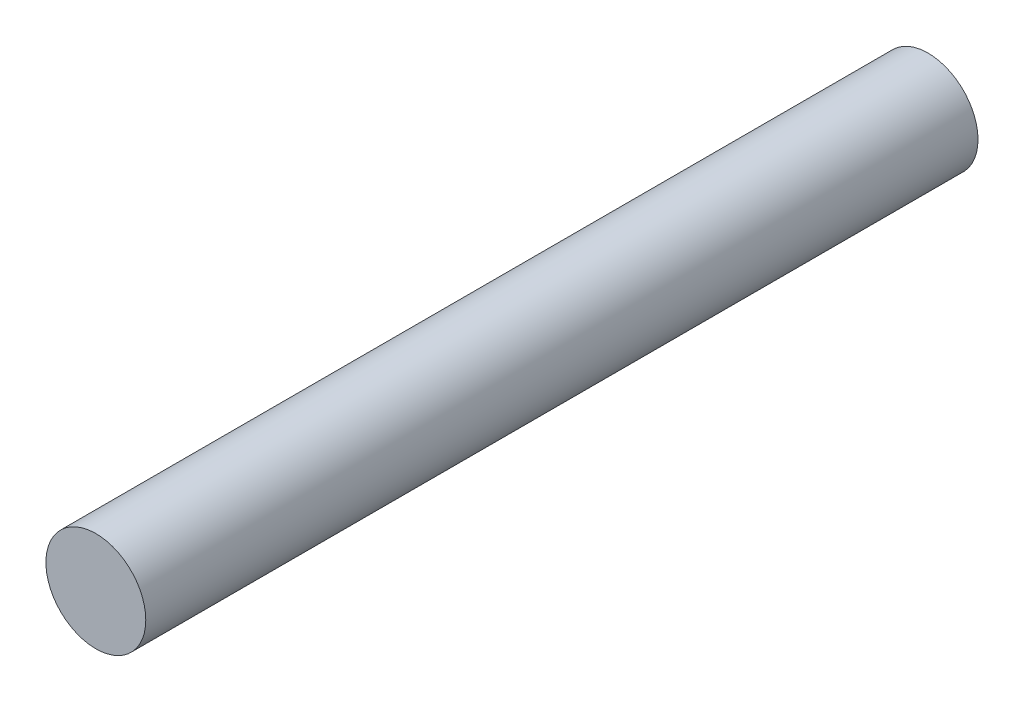
ISO-10303-21;
HEADER;
FILE_DESCRIPTION(('STEP AP214'),'2;1');
FILE_NAME('part.step','',(''),(''),'','','');
FILE_SCHEMA(('AUTOMOTIVE_DESIGN { 1 0 10303 214 1 1 1 1 }'));
ENDSEC;
DATA;
#1=APPLICATION_CONTEXT('core data for automotive mechanical design processes');
#2=APPLICATION_PROTOCOL_DEFINITION('international standard','automotive_design',2000,#1);
#3=PRODUCT_CONTEXT('',#1,'mechanical');
#4=PRODUCT('Part','Part','',(#3));
#5=PRODUCT_RELATED_PRODUCT_CATEGORY('part','',(#4));
#6=PRODUCT_DEFINITION_FORMATION('','',#4);
#7=PRODUCT_DEFINITION_CONTEXT('part definition',#1,'design');
#8=PRODUCT_DEFINITION('design','',#6,#7);
#9=PRODUCT_DEFINITION_SHAPE('','',#8);
#10=(LENGTH_UNIT() NAMED_UNIT(*) SI_UNIT(.MILLI.,.METRE.));
#11=(NAMED_UNIT(*) PLANE_ANGLE_UNIT() SI_UNIT($,.RADIAN.));
#12=(NAMED_UNIT(*) SI_UNIT($,.STERADIAN.) SOLID_ANGLE_UNIT());
#13=UNCERTAINTY_MEASURE_WITH_UNIT(LENGTH_MEASURE(1.E-05),#10,'distance_accuracy_value','');
#14=(GEOMETRIC_REPRESENTATION_CONTEXT(3) GLOBAL_UNCERTAINTY_ASSIGNED_CONTEXT((#13)) GLOBAL_UNIT_ASSIGNED_CONTEXT((#10,
#11,#12)) REPRESENTATION_CONTEXT('',''));
#15=CARTESIAN_POINT('',(0.,0.,0.));
#16=DIRECTION('',(0.,0.,1.));
#17=DIRECTION('',(1.,0.,0.));
#18=AXIS2_PLACEMENT_3D('',#15,#16,#17);
#19=CARTESIAN_POINT('',(0.,0.,25.));
#20=DIRECTION('',(0.,0.,-1.));
#21=DIRECTION('',(-1.,0.,0.));
#22=AXIS2_PLACEMENT_3D('',#19,#20,#21);
#23=CYLINDRICAL_SURFACE('',#22,1.5);
#24=CARTESIAN_POINT('',(0.,0.,25.));
#25=DIRECTION('',(0.,0.,1.));
#26=DIRECTION('',(1.,0.,0.));
#27=AXIS2_PLACEMENT_3D('',#24,#25,#26);
#28=CIRCLE('',#27,1.5);
#29=CARTESIAN_POINT('',(1.5,0.,25.));
#30=VERTEX_POINT('',#29);
#31=EDGE_CURVE('E10',#30,#30,#28,.T.);
#32=ORIENTED_EDGE('',*,*,#31,.F.);
#33=EDGE_LOOP('',(#32));
#34=FACE_BOUND('',#33,.T.);
#35=CARTESIAN_POINT('',(0.,0.,0.));
#36=DIRECTION('',(0.,0.,1.));
#37=DIRECTION('',(1.,0.,0.));
#38=AXIS2_PLACEMENT_3D('',#35,#36,#37);
#39=CIRCLE('',#38,1.5);
#40=CARTESIAN_POINT('',(1.5,0.,0.));
#41=VERTEX_POINT('',#40);
#42=EDGE_CURVE('E33',#41,#41,#39,.T.);
#43=ORIENTED_EDGE('',*,*,#42,.T.);
#44=EDGE_LOOP('',(#43));
#45=FACE_BOUND('',#44,.T.);
#46=ADVANCED_FACE('F30',(#34,#45),#23,.T.);
#47=CARTESIAN_POINT('',(0.,0.,25.));
#48=DIRECTION('',(0.,0.,1.));
#49=DIRECTION('',(1.,0.,0.));
#50=AXIS2_PLACEMENT_3D('',#47,#48,#49);
#51=PLANE('',#50);
#52=ORIENTED_EDGE('',*,*,#31,.T.);
#53=EDGE_LOOP('',(#52));
#54=FACE_BOUND('',#53,.T.);
#55=ADVANCED_FACE('F45',(#54),#51,.T.);
#56=CARTESIAN_POINT('',(0.,0.,0.));
#57=DIRECTION('',(0.,0.,1.));
#58=DIRECTION('',(1.,0.,0.));
#59=AXIS2_PLACEMENT_3D('',#56,#57,#58);
#60=PLANE('',#59);
#61=ORIENTED_EDGE('',*,*,#42,.F.);
#62=EDGE_LOOP('',(#61));
#63=FACE_BOUND('',#62,.T.);
#64=ADVANCED_FACE('F43',(#63),#60,.F.);
#65=CLOSED_SHELL('',(#46,#55,#64));
#66=MANIFOLD_SOLID_BREP('B2',#65);
#67=ADVANCED_BREP_SHAPE_REPRESENTATION('',(#18,#66),#14);
#68=SHAPE_DEFINITION_REPRESENTATION(#9,#67);
ENDSEC;
END-ISO-10303-21;
